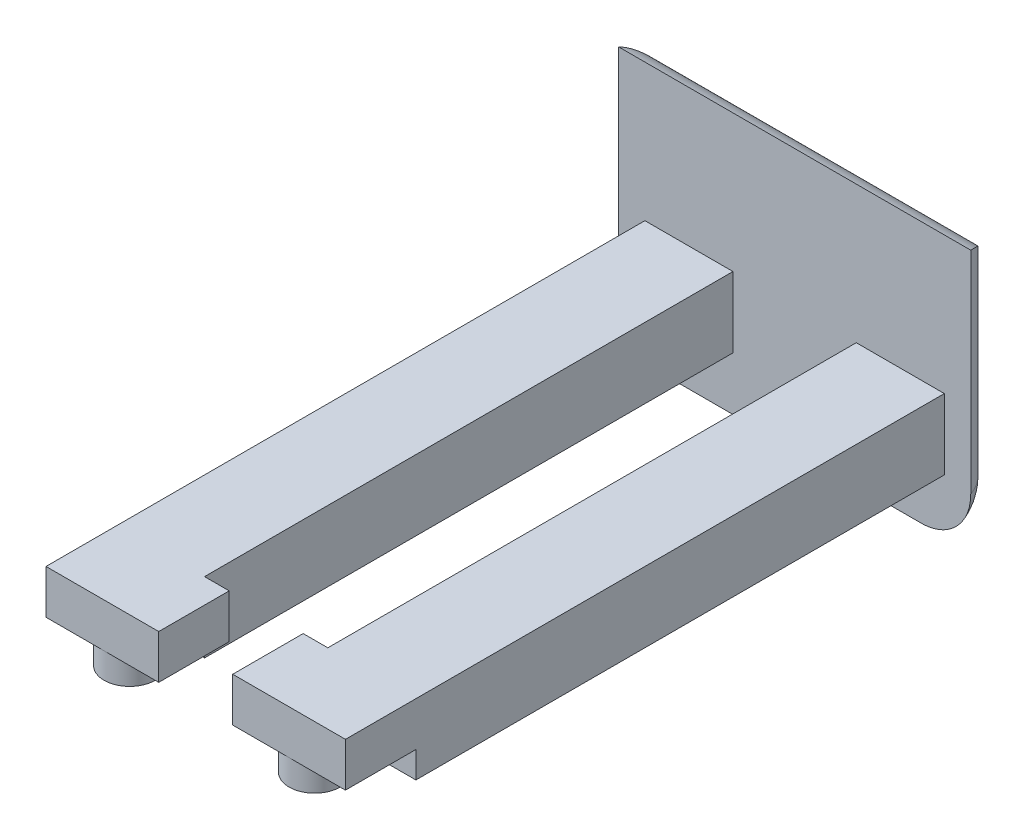
ISO-10303-21;
HEADER;
FILE_DESCRIPTION(('STEP AP214'),'2;1');
FILE_NAME('part.step','',(''),(''),'','','');
FILE_SCHEMA(('AUTOMOTIVE_DESIGN { 1 0 10303 214 1 1 1 1 }'));
ENDSEC;
DATA;
#1=APPLICATION_CONTEXT('core data for automotive mechanical design processes');
#2=APPLICATION_PROTOCOL_DEFINITION('international standard','automotive_design',2000,#1);
#3=PRODUCT_CONTEXT('',#1,'mechanical');
#4=PRODUCT('Part','Part','',(#3));
#5=PRODUCT_RELATED_PRODUCT_CATEGORY('part','',(#4));
#6=PRODUCT_DEFINITION_FORMATION('','',#4);
#7=PRODUCT_DEFINITION_CONTEXT('part definition',#1,'design');
#8=PRODUCT_DEFINITION('design','',#6,#7);
#9=PRODUCT_DEFINITION_SHAPE('','',#8);
#10=(LENGTH_UNIT() NAMED_UNIT(*) SI_UNIT(.MILLI.,.METRE.));
#11=(NAMED_UNIT(*) PLANE_ANGLE_UNIT() SI_UNIT($,.RADIAN.));
#12=(NAMED_UNIT(*) SI_UNIT($,.STERADIAN.) SOLID_ANGLE_UNIT());
#13=UNCERTAINTY_MEASURE_WITH_UNIT(LENGTH_MEASURE(1.E-05),#10,'distance_accuracy_value','');
#14=(GEOMETRIC_REPRESENTATION_CONTEXT(3) GLOBAL_UNCERTAINTY_ASSIGNED_CONTEXT((#13)) GLOBAL_UNIT_ASSIGNED_CONTEXT((#10,
#11,#12)) REPRESENTATION_CONTEXT('',''));
#15=CARTESIAN_POINT('',(0.,0.,0.));
#16=DIRECTION('',(0.,0.,1.));
#17=DIRECTION('',(1.,0.,0.));
#18=AXIS2_PLACEMENT_3D('',#15,#16,#17);
#19=CARTESIAN_POINT('',(-21.59,-0.762000000000002,81.28));
#20=DIRECTION('',(0.,-1.,0.));
#21=DIRECTION('',(0.,0.,-1.));
#22=AXIS2_PLACEMENT_3D('',#19,#20,#21);
#23=PLANE('',#22);
#24=DIRECTION('',(0.,0.,1.));
#25=VECTOR('',#24,1.);
#26=CARTESIAN_POINT('',(-5.33399999999999,-0.762000000000002,91.44));
#27=LINE('',#26,#25);
#28=CARTESIAN_POINT('',(-5.33399999999999,-0.762000000000002,81.28));
#29=VERTEX_POINT('',#28);
#30=CARTESIAN_POINT('',(-5.334,-0.762000000000002,91.44));
#31=VERTEX_POINT('',#30);
#32=EDGE_CURVE('E59',#29,#31,#27,.T.);
#33=ORIENTED_EDGE('',*,*,#32,.F.);
#34=DIRECTION('',(-1.,0.,0.));
#35=VECTOR('',#34,1.);
#36=CARTESIAN_POINT('',(-21.59,-0.762000000000002,81.28));
#37=LINE('',#36,#35);
#38=CARTESIAN_POINT('',(-8.89,-0.762000000000002,81.28));
#39=VERTEX_POINT('',#38);
#40=EDGE_CURVE('E245',#29,#39,#37,.T.);
#41=ORIENTED_EDGE('',*,*,#40,.T.);
#42=DIRECTION('',(0.,0.,1.));
#43=VECTOR('',#42,1.);
#44=CARTESIAN_POINT('',(-8.89,-0.762000000000003,-5.77088475655327));
#45=LINE('',#44,#43);
#46=CARTESIAN_POINT('',(-8.89,-0.762000000000003,5.08));
#47=VERTEX_POINT('',#46);
#48=EDGE_CURVE('E255',#47,#39,#45,.T.);
#49=ORIENTED_EDGE('',*,*,#48,.F.);
#50=DIRECTION('',(-1.,0.,0.));
#51=VECTOR('',#50,1.);
#52=CARTESIAN_POINT('',(-21.59,-0.762000000000002,5.08));
#53=LINE('',#52,#51);
#54=CARTESIAN_POINT('',(-21.59,-0.762000000000002,5.08));
#55=VERTEX_POINT('',#54);
#56=EDGE_CURVE('E290',#47,#55,#53,.T.);
#57=ORIENTED_EDGE('',*,*,#56,.T.);
#58=DIRECTION('',(0.,0.,-1.));
#59=VECTOR('',#58,1.);
#60=CARTESIAN_POINT('',(-21.59,-0.762000000000002,81.28));
#61=LINE('',#60,#59);
#62=CARTESIAN_POINT('',(-21.59,-0.762000000000002,91.44));
#63=VERTEX_POINT('',#62);
#64=EDGE_CURVE('E293',#63,#55,#61,.T.);
#65=ORIENTED_EDGE('',*,*,#64,.F.);
#66=DIRECTION('',(-1.,0.,0.));
#67=VECTOR('',#66,1.);
#68=CARTESIAN_POINT('',(-21.59,-0.762000000000002,91.44));
#69=LINE('',#68,#67);
#70=EDGE_CURVE('E199',#31,#63,#69,.T.);
#71=ORIENTED_EDGE('',*,*,#70,.F.);
#72=EDGE_LOOP('',(#33,#41,#49,#57,#65,#71));
#73=FACE_BOUND('',#72,.T.);
#74=ADVANCED_FACE('F42',(#73),#23,.F.);
#75=CARTESIAN_POINT('',(0.,-7.112,0.));
#76=DIRECTION('',(0.,-1.,0.));
#77=DIRECTION('',(0.,0.,-1.));
#78=AXIS2_PLACEMENT_3D('',#75,#76,#77);
#79=PLANE('',#78);
#80=CARTESIAN_POINT('',(-13.335,-7.112,87.63));
#81=DIRECTION('',(0.,-1.,0.));
#82=DIRECTION('',(0.,0.,-1.));
#83=AXIS2_PLACEMENT_3D('',#80,#81,#82);
#84=CIRCLE('',#83,3.683);
#85=CARTESIAN_POINT('',(-13.335,-7.112,83.947));
#86=VERTEX_POINT('',#85);
#87=EDGE_CURVE('E306',#86,#86,#84,.T.);
#88=ORIENTED_EDGE('',*,*,#87,.F.);
#89=EDGE_LOOP('',(#88));
#90=FACE_BOUND('',#89,.T.);
#91=DIRECTION('',(1.,0.,0.));
#92=VECTOR('',#91,1.);
#93=CARTESIAN_POINT('',(0.,-7.112,81.28));
#94=LINE('',#93,#92);
#95=CARTESIAN_POINT('',(-8.89,-7.112,81.28));
#96=VERTEX_POINT('',#95);
#97=CARTESIAN_POINT('',(-5.33399999999999,-7.112,81.28));
#98=VERTEX_POINT('',#97);
#99=EDGE_CURVE('E193',#96,#98,#94,.T.);
#100=ORIENTED_EDGE('',*,*,#99,.T.);
#101=DIRECTION('',(0.,0.,-1.));
#102=VECTOR('',#101,1.);
#103=CARTESIAN_POINT('',(-5.33399999999999,-7.112,91.44));
#104=LINE('',#103,#102);
#105=CARTESIAN_POINT('',(-5.33399999999999,-7.112,91.44));
#106=VERTEX_POINT('',#105);
#107=EDGE_CURVE('E180',#106,#98,#104,.T.);
#108=ORIENTED_EDGE('',*,*,#107,.F.);
#109=DIRECTION('',(1.,0.,0.));
#110=VECTOR('',#109,1.);
#111=CARTESIAN_POINT('',(-21.59,-7.112,91.44));
#112=LINE('',#111,#110);
#113=CARTESIAN_POINT('',(-21.59,-7.112,91.44));
#114=VERTEX_POINT('',#113);
#115=EDGE_CURVE('E190',#114,#106,#112,.T.);
#116=ORIENTED_EDGE('',*,*,#115,.F.);
#117=DIRECTION('',(0.,0.,-1.));
#118=VECTOR('',#117,1.);
#119=CARTESIAN_POINT('',(-21.59,-7.112,81.28));
#120=LINE('',#119,#118);
#121=CARTESIAN_POINT('',(-21.59,-7.112,81.28));
#122=VERTEX_POINT('',#121);
#123=EDGE_CURVE('E224',#114,#122,#120,.T.);
#124=ORIENTED_EDGE('',*,*,#123,.T.);
#125=DIRECTION('',(1.,0.,0.));
#126=VECTOR('',#125,1.);
#127=CARTESIAN_POINT('',(-5.07999999999999,-7.112,81.28));
#128=LINE('',#127,#126);
#129=EDGE_CURVE('E226',#122,#96,#128,.T.);
#130=ORIENTED_EDGE('',*,*,#129,.T.);
#131=EDGE_LOOP('',(#100,#108,#116,#124,#130));
#132=FACE_BOUND('',#131,.T.);
#133=ADVANCED_FACE('F189',(#90,#132),#79,.T.);
#134=CARTESIAN_POINT('',(0.,0.,81.28));
#135=DIRECTION('',(0.,0.,1.));
#136=DIRECTION('',(1.,0.,0.));
#137=AXIS2_PLACEMENT_3D('',#134,#135,#136);
#138=PLANE('',#137);
#139=DIRECTION('',(0.,1.,0.));
#140=VECTOR('',#139,1.);
#141=CARTESIAN_POINT('',(-5.33399999999999,-0.762000000000002,81.28));
#142=LINE('',#141,#140);
#143=EDGE_CURVE('E194',#98,#29,#142,.T.);
#144=ORIENTED_EDGE('',*,*,#143,.F.);
#145=ORIENTED_EDGE('',*,*,#99,.F.);
#146=DIRECTION('',(0.,-1.,0.));
#147=VECTOR('',#146,1.);
#148=CARTESIAN_POINT('',(-8.89,-0.762000000000003,81.28));
#149=LINE('',#148,#147);
#150=EDGE_CURVE('E252',#39,#96,#149,.T.);
#151=ORIENTED_EDGE('',*,*,#150,.F.);
#152=ORIENTED_EDGE('',*,*,#40,.F.);
#153=EDGE_LOOP('',(#144,#145,#151,#152));
#154=FACE_BOUND('',#153,.T.);
#155=ADVANCED_FACE('F378',(#154),#138,.F.);
#156=CARTESIAN_POINT('',(0.,0.,91.44));
#157=DIRECTION('',(0.,0.,1.));
#158=DIRECTION('',(1.,0.,0.));
#159=AXIS2_PLACEMENT_3D('',#156,#157,#158);
#160=PLANE('',#159);
#161=ORIENTED_EDGE('',*,*,#115,.T.);
#162=DIRECTION('',(0.,-1.,0.));
#163=VECTOR('',#162,1.);
#164=CARTESIAN_POINT('',(-5.33399999999999,-0.762000000000002,91.44));
#165=LINE('',#164,#163);
#166=EDGE_CURVE('E177',#31,#106,#165,.T.);
#167=ORIENTED_EDGE('',*,*,#166,.F.);
#168=ORIENTED_EDGE('',*,*,#70,.T.);
#169=DIRECTION('',(0.,-1.,0.));
#170=VECTOR('',#169,1.);
#171=CARTESIAN_POINT('',(-21.59,-0.762000000000002,91.44));
#172=LINE('',#171,#170);
#173=EDGE_CURVE('E198',#63,#114,#172,.T.);
#174=ORIENTED_EDGE('',*,*,#173,.T.);
#175=EDGE_LOOP('',(#161,#167,#168,#174));
#176=FACE_BOUND('',#175,.T.);
#177=ADVANCED_FACE('F196',(#176),#160,.T.);
#178=CARTESIAN_POINT('',(5.08,-0.762000000000002,81.28));
#179=DIRECTION('',(0.,-1.,0.));
#180=DIRECTION('',(0.,0.,-1.));
#181=AXIS2_PLACEMENT_3D('',#178,#179,#180);
#182=PLANE('',#181);
#183=DIRECTION('',(0.,0.,-1.));
#184=VECTOR('',#183,1.);
#185=CARTESIAN_POINT('',(5.33399999999999,-0.762000000000004,81.28));
#186=LINE('',#185,#184);
#187=CARTESIAN_POINT('',(5.33399999999999,-0.762000000000004,91.44));
#188=VERTEX_POINT('',#187);
#189=CARTESIAN_POINT('',(5.33399999999999,-0.762000000000004,81.28));
#190=VERTEX_POINT('',#189);
#191=EDGE_CURVE('E210',#188,#190,#186,.T.);
#192=ORIENTED_EDGE('',*,*,#191,.F.);
#193=DIRECTION('',(-1.,0.,0.));
#194=VECTOR('',#193,1.);
#195=CARTESIAN_POINT('',(5.07999999999999,-0.762000000000004,91.44));
#196=LINE('',#195,#194);
#197=CARTESIAN_POINT('',(21.59,-0.762000000000004,91.44));
#198=VERTEX_POINT('',#197);
#199=EDGE_CURVE('E203',#198,#188,#196,.T.);
#200=ORIENTED_EDGE('',*,*,#199,.F.);
#201=DIRECTION('',(0.,0.,-1.));
#202=VECTOR('',#201,1.);
#203=CARTESIAN_POINT('',(21.59,-0.762000000000002,81.28));
#204=LINE('',#203,#202);
#205=CARTESIAN_POINT('',(21.59,-0.762000000000002,5.08));
#206=VERTEX_POINT('',#205);
#207=EDGE_CURVE('E280',#198,#206,#204,.T.);
#208=ORIENTED_EDGE('',*,*,#207,.T.);
#209=DIRECTION('',(-1.,0.,0.));
#210=VECTOR('',#209,1.);
#211=CARTESIAN_POINT('',(5.08,-0.762000000000002,5.08));
#212=LINE('',#211,#210);
#213=CARTESIAN_POINT('',(8.89,-0.762000000000002,5.08));
#214=VERTEX_POINT('',#213);
#215=EDGE_CURVE('E277',#206,#214,#212,.T.);
#216=ORIENTED_EDGE('',*,*,#215,.T.);
#217=DIRECTION('',(0.,0.,1.));
#218=VECTOR('',#217,1.);
#219=CARTESIAN_POINT('',(8.89,-0.762000000000002,-5.77088475655327));
#220=LINE('',#219,#218);
#221=CARTESIAN_POINT('',(8.89,-0.762000000000002,81.28));
#222=VERTEX_POINT('',#221);
#223=EDGE_CURVE('E263',#214,#222,#220,.T.);
#224=ORIENTED_EDGE('',*,*,#223,.T.);
#225=DIRECTION('',(-1.,0.,0.));
#226=VECTOR('',#225,1.);
#227=CARTESIAN_POINT('',(21.59,-0.762000000000002,81.28));
#228=LINE('',#227,#226);
#229=EDGE_CURVE('E233',#222,#190,#228,.T.);
#230=ORIENTED_EDGE('',*,*,#229,.T.);
#231=EDGE_LOOP('',(#192,#200,#208,#216,#224,#230));
#232=FACE_BOUND('',#231,.T.);
#233=ADVANCED_FACE('F438',(#232),#182,.F.);
#234=CARTESIAN_POINT('',(0.,-7.112,0.));
#235=DIRECTION('',(0.,1.,0.));
#236=DIRECTION('',(0.,0.,1.));
#237=AXIS2_PLACEMENT_3D('',#234,#235,#236);
#238=PLANE('',#237);
#239=CARTESIAN_POINT('',(13.335,-7.112,87.63));
#240=DIRECTION('',(0.,-1.,0.));
#241=DIRECTION('',(0.,0.,-1.));
#242=AXIS2_PLACEMENT_3D('',#239,#240,#241);
#243=CIRCLE('',#242,3.683);
#244=CARTESIAN_POINT('',(13.335,-7.112,83.947));
#245=VERTEX_POINT('',#244);
#246=EDGE_CURVE('E214',#245,#245,#243,.T.);
#247=ORIENTED_EDGE('',*,*,#246,.F.);
#248=EDGE_LOOP('',(#247));
#249=FACE_BOUND('',#248,.T.);
#250=DIRECTION('',(0.,0.,1.));
#251=VECTOR('',#250,1.);
#252=CARTESIAN_POINT('',(5.33399999999999,-7.112,81.28));
#253=LINE('',#252,#251);
#254=CARTESIAN_POINT('',(5.33399999999999,-7.112,81.28));
#255=VERTEX_POINT('',#254);
#256=CARTESIAN_POINT('',(5.33399999999999,-7.112,91.44));
#257=VERTEX_POINT('',#256);
#258=EDGE_CURVE('E67',#255,#257,#253,.T.);
#259=ORIENTED_EDGE('',*,*,#258,.F.);
#260=DIRECTION('',(1.,0.,0.));
#261=VECTOR('',#260,1.);
#262=CARTESIAN_POINT('',(5.07999999999999,-7.112,81.28));
#263=LINE('',#262,#261);
#264=CARTESIAN_POINT('',(8.89,-7.112,81.28));
#265=VERTEX_POINT('',#264);
#266=EDGE_CURVE('E234',#255,#265,#263,.T.);
#267=ORIENTED_EDGE('',*,*,#266,.T.);
#268=CARTESIAN_POINT('',(21.59,-7.112,81.28));
#269=VERTEX_POINT('',#268);
#270=EDGE_CURVE('E237',#265,#269,#263,.T.);
#271=ORIENTED_EDGE('',*,*,#270,.T.);
#272=DIRECTION('',(0.,0.,1.));
#273=VECTOR('',#272,1.);
#274=CARTESIAN_POINT('',(21.59,-7.112,81.28));
#275=LINE('',#274,#273);
#276=CARTESIAN_POINT('',(21.59,-7.112,91.44));
#277=VERTEX_POINT('',#276);
#278=EDGE_CURVE('E236',#269,#277,#275,.T.);
#279=ORIENTED_EDGE('',*,*,#278,.T.);
#280=DIRECTION('',(1.,0.,0.));
#281=VECTOR('',#280,1.);
#282=CARTESIAN_POINT('',(5.07999999999999,-7.112,91.44));
#283=LINE('',#282,#281);
#284=EDGE_CURVE('E207',#257,#277,#283,.T.);
#285=ORIENTED_EDGE('',*,*,#284,.F.);
#286=EDGE_LOOP('',(#259,#267,#271,#279,#285));
#287=FACE_BOUND('',#286,.T.);
#288=ADVANCED_FACE('F442',(#249,#287),#238,.F.);
#289=CARTESIAN_POINT('',(0.,0.,81.28));
#290=DIRECTION('',(0.,0.,-1.));
#291=DIRECTION('',(-1.,0.,0.));
#292=AXIS2_PLACEMENT_3D('',#289,#290,#291);
#293=PLANE('',#292);
#294=ORIENTED_EDGE('',*,*,#266,.F.);
#295=DIRECTION('',(0.,-1.,0.));
#296=VECTOR('',#295,1.);
#297=CARTESIAN_POINT('',(5.33399999999999,-0.762000000000004,81.28));
#298=LINE('',#297,#296);
#299=EDGE_CURVE('E545',#190,#255,#298,.T.);
#300=ORIENTED_EDGE('',*,*,#299,.F.);
#301=ORIENTED_EDGE('',*,*,#229,.F.);
#302=DIRECTION('',(0.,1.,0.));
#303=VECTOR('',#302,1.);
#304=CARTESIAN_POINT('',(8.89,-0.762000000000002,81.28));
#305=LINE('',#304,#303);
#306=EDGE_CURVE('E247',#265,#222,#305,.T.);
#307=ORIENTED_EDGE('',*,*,#306,.F.);
#308=EDGE_LOOP('',(#294,#300,#301,#307));
#309=FACE_BOUND('',#308,.T.);
#310=ADVANCED_FACE('F451',(#309),#293,.T.);
#311=CARTESIAN_POINT('',(0.,0.,91.44));
#312=DIRECTION('',(0.,0.,1.));
#313=DIRECTION('',(1.,0.,0.));
#314=AXIS2_PLACEMENT_3D('',#311,#312,#313);
#315=PLANE('',#314);
#316=ORIENTED_EDGE('',*,*,#199,.T.);
#317=DIRECTION('',(0.,1.,0.));
#318=VECTOR('',#317,1.);
#319=CARTESIAN_POINT('',(5.33399999999999,-0.762000000000004,91.44));
#320=LINE('',#319,#318);
#321=EDGE_CURVE('E548',#257,#188,#320,.T.);
#322=ORIENTED_EDGE('',*,*,#321,.F.);
#323=ORIENTED_EDGE('',*,*,#284,.T.);
#324=DIRECTION('',(0.,1.,0.));
#325=VECTOR('',#324,1.);
#326=CARTESIAN_POINT('',(21.59,-0.762000000000004,91.44));
#327=LINE('',#326,#325);
#328=EDGE_CURVE('E209',#277,#198,#327,.T.);
#329=ORIENTED_EDGE('',*,*,#328,.T.);
#330=EDGE_LOOP('',(#316,#322,#323,#329));
#331=FACE_BOUND('',#330,.T.);
#332=ADVANCED_FACE('F394',(#331),#315,.T.);
#333=CARTESIAN_POINT('',(-21.59,-0.762000000000002,81.28));
#334=DIRECTION('',(1.,0.,0.));
#335=DIRECTION('',(0.,0.,-1.));
#336=AXIS2_PLACEMENT_3D('',#333,#334,#335);
#337=PLANE('',#336);
#338=ORIENTED_EDGE('',*,*,#173,.F.);
#339=ORIENTED_EDGE('',*,*,#64,.T.);
#340=DIRECTION('',(0.,-1.,0.));
#341=VECTOR('',#340,1.);
#342=CARTESIAN_POINT('',(-21.59,-0.762000000000002,5.08));
#343=LINE('',#342,#341);
#344=CARTESIAN_POINT('',(-21.59,-10.922,5.08));
#345=VERTEX_POINT('',#344);
#346=EDGE_CURVE('E284',#55,#345,#343,.T.);
#347=ORIENTED_EDGE('',*,*,#346,.T.);
#348=DIRECTION('',(0.,0.,-1.));
#349=VECTOR('',#348,1.);
#350=CARTESIAN_POINT('',(-21.59,-10.922,81.28));
#351=LINE('',#350,#349);
#352=CARTESIAN_POINT('',(-21.59,-10.922,81.28));
#353=VERTEX_POINT('',#352);
#354=EDGE_CURVE('E295',#353,#345,#351,.T.);
#355=ORIENTED_EDGE('',*,*,#354,.F.);
#356=DIRECTION('',(0.,-1.,0.));
#357=VECTOR('',#356,1.);
#358=CARTESIAN_POINT('',(-21.59,-7.112,81.28));
#359=LINE('',#358,#357);
#360=EDGE_CURVE('E229',#122,#353,#359,.T.);
#361=ORIENTED_EDGE('',*,*,#360,.F.);
#362=ORIENTED_EDGE('',*,*,#123,.F.);
#363=EDGE_LOOP('',(#338,#339,#347,#355,#361,#362));
#364=FACE_BOUND('',#363,.T.);
#365=ADVANCED_FACE('F390',(#364),#337,.F.);
#366=CARTESIAN_POINT('',(21.59,-0.762000000000002,81.28));
#367=DIRECTION('',(-1.,0.,0.));
#368=DIRECTION('',(0.,0.,1.));
#369=AXIS2_PLACEMENT_3D('',#366,#367,#368);
#370=PLANE('',#369);
#371=ORIENTED_EDGE('',*,*,#328,.F.);
#372=ORIENTED_EDGE('',*,*,#278,.F.);
#373=DIRECTION('',(0.,-1.,0.));
#374=VECTOR('',#373,1.);
#375=CARTESIAN_POINT('',(21.59,-7.112,81.28));
#376=LINE('',#375,#374);
#377=CARTESIAN_POINT('',(21.59,-10.922,81.28));
#378=VERTEX_POINT('',#377);
#379=EDGE_CURVE('E231',#269,#378,#376,.T.);
#380=ORIENTED_EDGE('',*,*,#379,.T.);
#381=DIRECTION('',(0.,0.,-1.));
#382=VECTOR('',#381,1.);
#383=CARTESIAN_POINT('',(21.59,-10.922,81.28));
#384=LINE('',#383,#382);
#385=CARTESIAN_POINT('',(21.59,-10.922,5.08));
#386=VERTEX_POINT('',#385);
#387=EDGE_CURVE('E282',#378,#386,#384,.T.);
#388=ORIENTED_EDGE('',*,*,#387,.T.);
#389=DIRECTION('',(0.,1.,0.));
#390=VECTOR('',#389,1.);
#391=CARTESIAN_POINT('',(21.59,-0.762000000000002,5.08));
#392=LINE('',#391,#390);
#393=EDGE_CURVE('E274',#386,#206,#392,.T.);
#394=ORIENTED_EDGE('',*,*,#393,.T.);
#395=ORIENTED_EDGE('',*,*,#207,.F.);
#396=EDGE_LOOP('',(#371,#372,#380,#388,#394,#395));
#397=FACE_BOUND('',#396,.T.);
#398=ADVANCED_FACE('F393',(#397),#370,.F.);
#399=CARTESIAN_POINT('',(0.,0.,5.08));
#400=DIRECTION('',(0.,0.,1.));
#401=DIRECTION('',(1.,0.,0.));
#402=AXIS2_PLACEMENT_3D('',#399,#400,#401);
#403=PLANE('',#402);
#404=DIRECTION('',(0.,-1.,0.));
#405=VECTOR('',#404,1.);
#406=CARTESIAN_POINT('',(-25.4,-19.05,5.08));
#407=LINE('',#406,#405);
#408=CARTESIAN_POINT('',(-25.4,19.05,5.08));
#409=VERTEX_POINT('',#408);
#410=CARTESIAN_POINT('',(-25.4,-11.43,5.08));
#411=VERTEX_POINT('',#410);
#412=EDGE_CURVE('E297',#409,#411,#407,.T.);
#413=ORIENTED_EDGE('',*,*,#412,.T.);
#414=CARTESIAN_POINT('',(-18.2157951031447,-11.43,5.08));
#415=DIRECTION('',(0.,0.,1.));
#416=DIRECTION('',(1.,0.,0.));
#417=AXIS2_PLACEMENT_3D('',#414,#415,#416);
#418=CIRCLE('',#417,7.18420489685532);
#419=CARTESIAN_POINT('',(-18.2157951031447,-18.6142048968553,5.08));
#420=VERTEX_POINT('',#419);
#421=EDGE_CURVE('E328',#411,#420,#418,.T.);
#422=ORIENTED_EDGE('',*,*,#421,.T.);
#423=DIRECTION('',(1.,0.,0.));
#424=VECTOR('',#423,1.);
#425=CARTESIAN_POINT('',(0.,-18.6142048968553,5.08));
#426=LINE('',#425,#424);
#427=CARTESIAN_POINT('',(18.2157951031447,-18.6142048968553,5.08));
#428=VERTEX_POINT('',#427);
#429=EDGE_CURVE('E324',#420,#428,#426,.T.);
#430=ORIENTED_EDGE('',*,*,#429,.T.);
#431=CARTESIAN_POINT('',(18.2157951031447,-11.43,5.08));
#432=DIRECTION('',(0.,0.,1.));
#433=DIRECTION('',(1.,0.,0.));
#434=AXIS2_PLACEMENT_3D('',#431,#432,#433);
#435=CIRCLE('',#434,7.18420489685532);
#436=CARTESIAN_POINT('',(25.4,-11.43,5.08));
#437=VERTEX_POINT('',#436);
#438=EDGE_CURVE('E326',#428,#437,#435,.T.);
#439=ORIENTED_EDGE('',*,*,#438,.T.);
#440=DIRECTION('',(0.,1.,0.));
#441=VECTOR('',#440,1.);
#442=CARTESIAN_POINT('',(25.4,-19.05,5.08));
#443=LINE('',#442,#441);
#444=CARTESIAN_POINT('',(25.4,19.05,5.08));
#445=VERTEX_POINT('',#444);
#446=EDGE_CURVE('E300',#437,#445,#443,.T.);
#447=ORIENTED_EDGE('',*,*,#446,.T.);
#448=DIRECTION('',(-1.,0.,0.));
#449=VECTOR('',#448,1.);
#450=CARTESIAN_POINT('',(25.4,19.05,5.08));
#451=LINE('',#450,#449);
#452=EDGE_CURVE('E302',#445,#409,#451,.T.);
#453=ORIENTED_EDGE('',*,*,#452,.T.);
#454=EDGE_LOOP('',(#413,#422,#430,#439,#447,#453));
#455=FACE_BOUND('',#454,.T.);
#456=DIRECTION('',(0.,1.,0.));
#457=VECTOR('',#456,1.);
#458=CARTESIAN_POINT('',(-8.89,-0.762000000000003,5.08));
#459=LINE('',#458,#457);
#460=CARTESIAN_POINT('',(-8.89,-10.922,5.08));
#461=VERTEX_POINT('',#460);
#462=EDGE_CURVE('E248',#461,#47,#459,.T.);
#463=ORIENTED_EDGE('',*,*,#462,.F.);
#464=DIRECTION('',(1.,0.,0.));
#465=VECTOR('',#464,1.);
#466=CARTESIAN_POINT('',(-21.59,-10.922,5.08));
#467=LINE('',#466,#465);
#468=EDGE_CURVE('E287',#345,#461,#467,.T.);
#469=ORIENTED_EDGE('',*,*,#468,.F.);
#470=ORIENTED_EDGE('',*,*,#346,.F.);
#471=ORIENTED_EDGE('',*,*,#56,.F.);
#472=EDGE_LOOP('',(#463,#469,#470,#471));
#473=FACE_BOUND('',#472,.T.);
#474=DIRECTION('',(1.,0.,0.));
#475=VECTOR('',#474,1.);
#476=CARTESIAN_POINT('',(5.08,-10.922,5.08));
#477=LINE('',#476,#475);
#478=CARTESIAN_POINT('',(8.89,-10.922,5.08));
#479=VERTEX_POINT('',#478);
#480=EDGE_CURVE('E250',#479,#386,#477,.T.);
#481=ORIENTED_EDGE('',*,*,#480,.F.);
#482=DIRECTION('',(0.,-1.,0.));
#483=VECTOR('',#482,1.);
#484=CARTESIAN_POINT('',(8.89,-0.762000000000002,5.08));
#485=LINE('',#484,#483);
#486=EDGE_CURVE('E261',#214,#479,#485,.T.);
#487=ORIENTED_EDGE('',*,*,#486,.F.);
#488=ORIENTED_EDGE('',*,*,#215,.F.);
#489=ORIENTED_EDGE('',*,*,#393,.F.);
#490=EDGE_LOOP('',(#481,#487,#488,#489));
#491=FACE_BOUND('',#490,.T.);
#492=ADVANCED_FACE('F345',(#455,#473,#491),#403,.T.);
#493=CARTESIAN_POINT('',(0.,0.,0.));
#494=DIRECTION('',(0.,0.,1.));
#495=DIRECTION('',(1.,0.,0.));
#496=AXIS2_PLACEMENT_3D('',#493,#494,#495);
#497=PLANE('',#496);
#498=DIRECTION('',(0.,1.,0.));
#499=VECTOR('',#498,1.);
#500=CARTESIAN_POINT('',(18.2157951031447,0.,0.));
#501=LINE('',#500,#499);
#502=CARTESIAN_POINT('',(18.2157951031447,11.8657951031447,0.));
#503=VERTEX_POINT('',#502);
#504=CARTESIAN_POINT('',(18.2157951031447,-11.43,0.));
#505=VERTEX_POINT('',#504);
#506=EDGE_CURVE('E312',#503,#505,#501,.F.);
#507=ORIENTED_EDGE('',*,*,#506,.T.);
#508=DIRECTION('',(1.,0.,0.));
#509=VECTOR('',#508,1.);
#510=CARTESIAN_POINT('',(0.,-11.43,0.));
#511=LINE('',#510,#509);
#512=CARTESIAN_POINT('',(-18.2157951031447,-11.43,0.));
#513=VERTEX_POINT('',#512);
#514=EDGE_CURVE('E11',#505,#513,#511,.F.);
#515=ORIENTED_EDGE('',*,*,#514,.T.);
#516=DIRECTION('',(0.,-1.,0.));
#517=VECTOR('',#516,1.);
#518=CARTESIAN_POINT('',(-18.2157951031447,0.,0.));
#519=LINE('',#518,#517);
#520=CARTESIAN_POINT('',(-18.2157951031447,11.8657951031447,0.));
#521=VERTEX_POINT('',#520);
#522=EDGE_CURVE('E315',#513,#521,#519,.F.);
#523=ORIENTED_EDGE('',*,*,#522,.T.);
#524=DIRECTION('',(-1.,0.,0.));
#525=VECTOR('',#524,1.);
#526=CARTESIAN_POINT('',(0.,11.8657951031447,0.));
#527=LINE('',#526,#525);
#528=EDGE_CURVE('E309',#521,#503,#527,.F.);
#529=ORIENTED_EDGE('',*,*,#528,.T.);
#530=EDGE_LOOP('',(#507,#515,#523,#529));
#531=FACE_BOUND('',#530,.T.);
#532=ADVANCED_FACE('F388',(#531),#497,.F.);
#533=CARTESIAN_POINT('',(-21.59,-10.922,81.28));
#534=DIRECTION('',(0.,1.,0.));
#535=DIRECTION('',(0.,0.,1.));
#536=AXIS2_PLACEMENT_3D('',#533,#534,#535);
#537=PLANE('',#536);
#538=DIRECTION('',(0.,0.,1.));
#539=VECTOR('',#538,1.);
#540=CARTESIAN_POINT('',(-8.89,-10.922,-5.77088475655327));
#541=LINE('',#540,#539);
#542=CARTESIAN_POINT('',(-8.89,-10.922,81.28));
#543=VERTEX_POINT('',#542);
#544=EDGE_CURVE('E251',#461,#543,#541,.T.);
#545=ORIENTED_EDGE('',*,*,#544,.T.);
#546=DIRECTION('',(1.,0.,0.));
#547=VECTOR('',#546,1.);
#548=CARTESIAN_POINT('',(-5.07999999999999,-10.922,81.28));
#549=LINE('',#548,#547);
#550=EDGE_CURVE('E227',#353,#543,#549,.T.);
#551=ORIENTED_EDGE('',*,*,#550,.F.);
#552=ORIENTED_EDGE('',*,*,#354,.T.);
#553=ORIENTED_EDGE('',*,*,#468,.T.);
#554=EDGE_LOOP('',(#545,#551,#552,#553));
#555=FACE_BOUND('',#554,.T.);
#556=ADVANCED_FACE('F385',(#555),#537,.F.);
#557=CARTESIAN_POINT('',(5.08,-10.922,81.28));
#558=DIRECTION('',(0.,1.,0.));
#559=DIRECTION('',(0.,0.,1.));
#560=AXIS2_PLACEMENT_3D('',#557,#558,#559);
#561=PLANE('',#560);
#562=ORIENTED_EDGE('',*,*,#387,.F.);
#563=DIRECTION('',(1.,0.,0.));
#564=VECTOR('',#563,1.);
#565=CARTESIAN_POINT('',(5.07999999999999,-10.922,81.28));
#566=LINE('',#565,#564);
#567=CARTESIAN_POINT('',(8.89,-10.922,81.28));
#568=VERTEX_POINT('',#567);
#569=EDGE_CURVE('E223',#568,#378,#566,.T.);
#570=ORIENTED_EDGE('',*,*,#569,.F.);
#571=DIRECTION('',(0.,0.,1.));
#572=VECTOR('',#571,1.);
#573=CARTESIAN_POINT('',(8.89,-10.922,-5.77088475655327));
#574=LINE('',#573,#572);
#575=EDGE_CURVE('E267',#479,#568,#574,.T.);
#576=ORIENTED_EDGE('',*,*,#575,.F.);
#577=ORIENTED_EDGE('',*,*,#480,.T.);
#578=EDGE_LOOP('',(#562,#570,#576,#577));
#579=FACE_BOUND('',#578,.T.);
#580=ADVANCED_FACE('F383',(#579),#561,.F.);
#581=CARTESIAN_POINT('',(8.89,-0.762000000000002,-5.77088475655327));
#582=DIRECTION('',(1.,0.,0.));
#583=DIRECTION('',(0.,1.,0.));
#584=AXIS2_PLACEMENT_3D('',#581,#582,#583);
#585=PLANE('',#584);
#586=ORIENTED_EDGE('',*,*,#486,.T.);
#587=ORIENTED_EDGE('',*,*,#575,.T.);
#588=EDGE_CURVE('E264',#568,#265,#305,.T.);
#589=ORIENTED_EDGE('',*,*,#588,.T.);
#590=ORIENTED_EDGE('',*,*,#306,.T.);
#591=ORIENTED_EDGE('',*,*,#223,.F.);
#592=EDGE_LOOP('',(#586,#587,#589,#590,#591));
#593=FACE_BOUND('',#592,.T.);
#594=ADVANCED_FACE('F519',(#593),#585,.F.);
#595=CARTESIAN_POINT('',(-8.89,-0.762000000000003,-5.77088475655327));
#596=DIRECTION('',(-1.,0.,0.));
#597=DIRECTION('',(0.,-1.,0.));
#598=AXIS2_PLACEMENT_3D('',#595,#596,#597);
#599=PLANE('',#598);
#600=ORIENTED_EDGE('',*,*,#462,.T.);
#601=ORIENTED_EDGE('',*,*,#48,.T.);
#602=ORIENTED_EDGE('',*,*,#150,.T.);
#603=EDGE_CURVE('E256',#96,#543,#149,.T.);
#604=ORIENTED_EDGE('',*,*,#603,.T.);
#605=ORIENTED_EDGE('',*,*,#544,.F.);
#606=EDGE_LOOP('',(#600,#601,#602,#604,#605));
#607=FACE_BOUND('',#606,.T.);
#608=ADVANCED_FACE('F515',(#607),#599,.F.);
#609=CARTESIAN_POINT('',(5.07999999999999,-7.112,81.28));
#610=DIRECTION('',(0.,0.,-1.));
#611=DIRECTION('',(-1.,0.,0.));
#612=AXIS2_PLACEMENT_3D('',#609,#610,#611);
#613=PLANE('',#612);
#614=ORIENTED_EDGE('',*,*,#569,.T.);
#615=ORIENTED_EDGE('',*,*,#379,.F.);
#616=ORIENTED_EDGE('',*,*,#270,.F.);
#617=ORIENTED_EDGE('',*,*,#588,.F.);
#618=EDGE_LOOP('',(#614,#615,#616,#617));
#619=FACE_BOUND('',#618,.T.);
#620=ADVANCED_FACE('F518',(#619),#613,.F.);
#621=CARTESIAN_POINT('',(-5.07999999999999,-7.112,81.28));
#622=DIRECTION('',(0.,0.,-1.));
#623=DIRECTION('',(-1.,0.,0.));
#624=AXIS2_PLACEMENT_3D('',#621,#622,#623);
#625=PLANE('',#624);
#626=ORIENTED_EDGE('',*,*,#129,.F.);
#627=ORIENTED_EDGE('',*,*,#360,.T.);
#628=ORIENTED_EDGE('',*,*,#550,.T.);
#629=ORIENTED_EDGE('',*,*,#603,.F.);
#630=EDGE_LOOP('',(#626,#627,#628,#629));
#631=FACE_BOUND('',#630,.T.);
#632=ADVANCED_FACE('F570',(#631),#625,.F.);
#633=CARTESIAN_POINT('',(-13.335,-7.112,87.63));
#634=DIRECTION('',(0.,-1.,0.));
#635=DIRECTION('',(0.,0.,-1.));
#636=AXIS2_PLACEMENT_3D('',#633,#634,#635);
#637=CYLINDRICAL_SURFACE('',#636,3.683);
#638=CARTESIAN_POINT('',(-13.335,-10.922,87.63));
#639=DIRECTION('',(0.,-1.,0.));
#640=DIRECTION('',(0.,0.,-1.));
#641=AXIS2_PLACEMENT_3D('',#638,#639,#640);
#642=CIRCLE('',#641,3.683);
#643=CARTESIAN_POINT('',(-13.335,-10.922,83.947));
#644=VERTEX_POINT('',#643);
#645=EDGE_CURVE('E217',#644,#644,#642,.T.);
#646=CARTESIAN_POINT('',(-13.335,-7.112,83.947));
#647=CARTESIAN_POINT('',(-13.335,-7.1516875,83.947));
#648=CARTESIAN_POINT('',(-13.335,-7.191375,83.947));
#649=CARTESIAN_POINT('',(-13.335,-7.27075,83.947));
#650=CARTESIAN_POINT('',(-13.335,-7.3104375,83.947));
#651=CARTESIAN_POINT('',(-13.335,-7.3898125,83.947));
#652=CARTESIAN_POINT('',(-13.335,-7.4295,83.947));
#653=CARTESIAN_POINT('',(-13.335,-7.508875,83.947));
#654=CARTESIAN_POINT('',(-13.335,-7.5485625,83.947));
#655=CARTESIAN_POINT('',(-13.335,-7.6279375,83.947));
#656=CARTESIAN_POINT('',(-13.335,-7.667625,83.947));
#657=CARTESIAN_POINT('',(-13.335,-7.747,83.947));
#658=CARTESIAN_POINT('',(-13.335,-7.7866875,83.947));
#659=CARTESIAN_POINT('',(-13.335,-7.8660625,83.947));
#660=CARTESIAN_POINT('',(-13.335,-7.90575,83.947));
#661=CARTESIAN_POINT('',(-13.335,-7.985125,83.947));
#662=CARTESIAN_POINT('',(-13.335,-8.0248125,83.947));
#663=CARTESIAN_POINT('',(-13.335,-8.1041875,83.947));
#664=CARTESIAN_POINT('',(-13.335,-8.143875,83.947));
#665=CARTESIAN_POINT('',(-13.335,-8.22325,83.947));
#666=CARTESIAN_POINT('',(-13.335,-8.2629375,83.947));
#667=CARTESIAN_POINT('',(-13.335,-8.3423125,83.947));
#668=CARTESIAN_POINT('',(-13.335,-8.382,83.947));
#669=CARTESIAN_POINT('',(-13.335,-8.461375,83.947));
#670=CARTESIAN_POINT('',(-13.335,-8.5010625,83.947));
#671=CARTESIAN_POINT('',(-13.335,-8.5804375,83.947));
#672=CARTESIAN_POINT('',(-13.335,-8.620125,83.947));
#673=CARTESIAN_POINT('',(-13.335,-8.6995,83.947));
#674=CARTESIAN_POINT('',(-13.335,-8.7391875,83.947));
#675=CARTESIAN_POINT('',(-13.335,-8.8185625,83.947));
#676=CARTESIAN_POINT('',(-13.335,-8.85825,83.947));
#677=CARTESIAN_POINT('',(-13.335,-8.937625,83.947));
#678=CARTESIAN_POINT('',(-13.335,-8.9773125,83.947));
#679=CARTESIAN_POINT('',(-13.335,-9.0566875,83.947));
#680=CARTESIAN_POINT('',(-13.335,-9.096375,83.947));
#681=CARTESIAN_POINT('',(-13.335,-9.17575,83.947));
#682=CARTESIAN_POINT('',(-13.335,-9.2154375,83.947));
#683=CARTESIAN_POINT('',(-13.335,-9.2948125,83.947));
#684=CARTESIAN_POINT('',(-13.335,-9.3345,83.947));
#685=CARTESIAN_POINT('',(-13.335,-9.413875,83.947));
#686=CARTESIAN_POINT('',(-13.335,-9.4535625,83.947));
#687=CARTESIAN_POINT('',(-13.335,-9.5329375,83.947));
#688=CARTESIAN_POINT('',(-13.335,-9.572625,83.947));
#689=CARTESIAN_POINT('',(-13.335,-9.652,83.947));
#690=CARTESIAN_POINT('',(-13.335,-9.6916875,83.947));
#691=CARTESIAN_POINT('',(-13.335,-9.7710625,83.947));
#692=CARTESIAN_POINT('',(-13.335,-9.81075,83.947));
#693=CARTESIAN_POINT('',(-13.335,-9.890125,83.947));
#694=CARTESIAN_POINT('',(-13.335,-9.9298125,83.947));
#695=CARTESIAN_POINT('',(-13.335,-10.0091875,83.947));
#696=CARTESIAN_POINT('',(-13.335,-10.048875,83.947));
#697=CARTESIAN_POINT('',(-13.335,-10.12825,83.947));
#698=CARTESIAN_POINT('',(-13.335,-10.1679375,83.947));
#699=CARTESIAN_POINT('',(-13.335,-10.2473125,83.947));
#700=CARTESIAN_POINT('',(-13.335,-10.287,83.947));
#701=CARTESIAN_POINT('',(-13.335,-10.366375,83.947));
#702=CARTESIAN_POINT('',(-13.335,-10.4060625,83.947));
#703=CARTESIAN_POINT('',(-13.335,-10.4854375,83.947));
#704=CARTESIAN_POINT('',(-13.335,-10.525125,83.947));
#705=CARTESIAN_POINT('',(-13.335,-10.6045,83.947));
#706=CARTESIAN_POINT('',(-13.335,-10.6441875,83.947));
#707=CARTESIAN_POINT('',(-13.335,-10.7235625,83.947));
#708=CARTESIAN_POINT('',(-13.335,-10.76325,83.947));
#709=CARTESIAN_POINT('',(-13.335,-10.842625,83.947));
#710=CARTESIAN_POINT('',(-13.335,-10.8823125,83.947));
#711=CARTESIAN_POINT('',(-13.335,-10.922,83.947));
#712=B_SPLINE_CURVE_WITH_KNOTS('',3,(#646,#647,#648,#649,#650,#651,#652,#653,#654,#655,#656,
#657,#658,#659,#660,#661,#662,#663,#664,#665,#666,#667,#668,#669,#670,#671,#672,#673,#674,#675,
#676,#677,#678,#679,#680,#681,#682,#683,#684,#685,#686,#687,#688,#689,#690,#691,#692,#693,#694,
#695,#696,#697,#698,#699,#700,#701,#702,#703,#704,#705,#706,#707,#708,#709,#710,#711),
.UNSPECIFIED.,.F.,.F.,(4,2,2,2,2,2,2,2,2,2,2,2,2,2,2,2,2,2,2,2,2,2,2,2,2,2,2,2,2,2,2,2,4),(0.,
0.119062499999999,0.238125,0.3571875,0.476249999999999,0.595312499999999,0.714375,
0.833437499999999,0.952499999999998,1.0715625,1.190625,1.3096875,1.42875,1.5478125,1.666875,
1.7859375,1.905,2.0240625,2.143125,2.2621875,2.38125,2.5003125,2.619375,2.7384375,2.8575,
2.9765625,3.095625,3.2146875,3.33375,3.4528125,3.571875,3.6909375,3.81),.UNSPECIFIED.);
#713=EDGE_CURVE('BSEAM573',#86,#644,#712,.T.);
#714=ORIENTED_EDGE('',*,*,#87,.T.);
#715=ORIENTED_EDGE('',*,*,#645,.F.);
#716=ORIENTED_EDGE('',*,*,#713,.T.);
#717=ORIENTED_EDGE('',*,*,#713,.F.);
#718=EDGE_LOOP('',(#714,#716,#715,#717));
#719=FACE_BOUND('',#718,.T.);
#720=ADVANCED_FACE('F573',(#719),#637,.T.);
#721=CARTESIAN_POINT('',(-13.335,-10.922,87.63));
#722=DIRECTION('',(0.,-1.,0.));
#723=DIRECTION('',(0.,0.,-1.));
#724=AXIS2_PLACEMENT_3D('',#721,#722,#723);
#725=PLANE('',#724);
#726=ORIENTED_EDGE('',*,*,#645,.T.);
#727=EDGE_LOOP('',(#726));
#728=FACE_BOUND('',#727,.T.);
#729=ADVANCED_FACE('F579',(#728),#725,.T.);
#730=CARTESIAN_POINT('',(13.335,-7.112,87.63));
#731=DIRECTION('',(0.,-1.,0.));
#732=DIRECTION('',(0.,0.,-1.));
#733=AXIS2_PLACEMENT_3D('',#730,#731,#732);
#734=CYLINDRICAL_SURFACE('',#733,3.683);
#735=CARTESIAN_POINT('',(13.335,-10.922,87.63));
#736=DIRECTION('',(0.,-1.,0.));
#737=DIRECTION('',(0.,0.,-1.));
#738=AXIS2_PLACEMENT_3D('',#735,#736,#737);
#739=CIRCLE('',#738,3.683);
#740=CARTESIAN_POINT('',(13.335,-10.922,83.947));
#741=VERTEX_POINT('',#740);
#742=EDGE_CURVE('E218',#741,#741,#739,.T.);
#743=CARTESIAN_POINT('',(13.335,-7.112,83.947));
#744=CARTESIAN_POINT('',(13.335,-7.1516875,83.947));
#745=CARTESIAN_POINT('',(13.335,-7.191375,83.947));
#746=CARTESIAN_POINT('',(13.335,-7.27075,83.947));
#747=CARTESIAN_POINT('',(13.335,-7.3104375,83.947));
#748=CARTESIAN_POINT('',(13.335,-7.3898125,83.947));
#749=CARTESIAN_POINT('',(13.335,-7.4295,83.947));
#750=CARTESIAN_POINT('',(13.335,-7.508875,83.947));
#751=CARTESIAN_POINT('',(13.335,-7.5485625,83.947));
#752=CARTESIAN_POINT('',(13.335,-7.6279375,83.947));
#753=CARTESIAN_POINT('',(13.335,-7.667625,83.947));
#754=CARTESIAN_POINT('',(13.335,-7.747,83.947));
#755=CARTESIAN_POINT('',(13.335,-7.7866875,83.947));
#756=CARTESIAN_POINT('',(13.335,-7.8660625,83.947));
#757=CARTESIAN_POINT('',(13.335,-7.90575,83.947));
#758=CARTESIAN_POINT('',(13.335,-7.985125,83.947));
#759=CARTESIAN_POINT('',(13.335,-8.0248125,83.947));
#760=CARTESIAN_POINT('',(13.335,-8.1041875,83.947));
#761=CARTESIAN_POINT('',(13.335,-8.143875,83.947));
#762=CARTESIAN_POINT('',(13.335,-8.22325,83.947));
#763=CARTESIAN_POINT('',(13.335,-8.2629375,83.947));
#764=CARTESIAN_POINT('',(13.335,-8.3423125,83.947));
#765=CARTESIAN_POINT('',(13.335,-8.382,83.947));
#766=CARTESIAN_POINT('',(13.335,-8.461375,83.947));
#767=CARTESIAN_POINT('',(13.335,-8.5010625,83.947));
#768=CARTESIAN_POINT('',(13.335,-8.5804375,83.947));
#769=CARTESIAN_POINT('',(13.335,-8.620125,83.947));
#770=CARTESIAN_POINT('',(13.335,-8.6995,83.947));
#771=CARTESIAN_POINT('',(13.335,-8.7391875,83.947));
#772=CARTESIAN_POINT('',(13.335,-8.8185625,83.947));
#773=CARTESIAN_POINT('',(13.335,-8.85825,83.947));
#774=CARTESIAN_POINT('',(13.335,-8.937625,83.947));
#775=CARTESIAN_POINT('',(13.335,-8.9773125,83.947));
#776=CARTESIAN_POINT('',(13.335,-9.0566875,83.947));
#777=CARTESIAN_POINT('',(13.335,-9.096375,83.947));
#778=CARTESIAN_POINT('',(13.335,-9.17575,83.947));
#779=CARTESIAN_POINT('',(13.335,-9.2154375,83.947));
#780=CARTESIAN_POINT('',(13.335,-9.2948125,83.947));
#781=CARTESIAN_POINT('',(13.335,-9.3345,83.947));
#782=CARTESIAN_POINT('',(13.335,-9.413875,83.947));
#783=CARTESIAN_POINT('',(13.335,-9.4535625,83.947));
#784=CARTESIAN_POINT('',(13.335,-9.5329375,83.947));
#785=CARTESIAN_POINT('',(13.335,-9.572625,83.947));
#786=CARTESIAN_POINT('',(13.335,-9.652,83.947));
#787=CARTESIAN_POINT('',(13.335,-9.6916875,83.947));
#788=CARTESIAN_POINT('',(13.335,-9.7710625,83.947));
#789=CARTESIAN_POINT('',(13.335,-9.81075,83.947));
#790=CARTESIAN_POINT('',(13.335,-9.890125,83.947));
#791=CARTESIAN_POINT('',(13.335,-9.9298125,83.947));
#792=CARTESIAN_POINT('',(13.335,-10.0091875,83.947));
#793=CARTESIAN_POINT('',(13.335,-10.048875,83.947));
#794=CARTESIAN_POINT('',(13.335,-10.12825,83.947));
#795=CARTESIAN_POINT('',(13.335,-10.1679375,83.947));
#796=CARTESIAN_POINT('',(13.335,-10.2473125,83.947));
#797=CARTESIAN_POINT('',(13.335,-10.287,83.947));
#798=CARTESIAN_POINT('',(13.335,-10.366375,83.947));
#799=CARTESIAN_POINT('',(13.335,-10.4060625,83.947));
#800=CARTESIAN_POINT('',(13.335,-10.4854375,83.947));
#801=CARTESIAN_POINT('',(13.335,-10.525125,83.947));
#802=CARTESIAN_POINT('',(13.335,-10.6045,83.947));
#803=CARTESIAN_POINT('',(13.335,-10.6441875,83.947));
#804=CARTESIAN_POINT('',(13.335,-10.7235625,83.947));
#805=CARTESIAN_POINT('',(13.335,-10.76325,83.947));
#806=CARTESIAN_POINT('',(13.335,-10.842625,83.947));
#807=CARTESIAN_POINT('',(13.335,-10.8823125,83.947));
#808=CARTESIAN_POINT('',(13.335,-10.922,83.947));
#809=B_SPLINE_CURVE_WITH_KNOTS('',3,(#743,#744,#745,#746,#747,#748,#749,#750,#751,#752,#753,
#754,#755,#756,#757,#758,#759,#760,#761,#762,#763,#764,#765,#766,#767,#768,#769,#770,#771,#772,
#773,#774,#775,#776,#777,#778,#779,#780,#781,#782,#783,#784,#785,#786,#787,#788,#789,#790,#791,
#792,#793,#794,#795,#796,#797,#798,#799,#800,#801,#802,#803,#804,#805,#806,#807,#808),
.UNSPECIFIED.,.F.,.F.,(4,2,2,2,2,2,2,2,2,2,2,2,2,2,2,2,2,2,2,2,2,2,2,2,2,2,2,2,2,2,2,2,4),(0.,
0.119062499999999,0.238125,0.3571875,0.476249999999999,0.595312499999999,0.714375,
0.833437499999999,0.952499999999998,1.0715625,1.190625,1.3096875,1.42875,1.5478125,1.666875,
1.7859375,1.905,2.0240625,2.143125,2.2621875,2.38125,2.5003125,2.619375,2.7384375,2.8575,
2.9765625,3.095625,3.2146875,3.33375,3.4528125,3.571875,3.6909375,3.81),.UNSPECIFIED.);
#810=EDGE_CURVE('BSEAM585',#245,#741,#809,.T.);
#811=ORIENTED_EDGE('',*,*,#246,.T.);
#812=ORIENTED_EDGE('',*,*,#742,.F.);
#813=ORIENTED_EDGE('',*,*,#810,.T.);
#814=ORIENTED_EDGE('',*,*,#810,.F.);
#815=EDGE_LOOP('',(#811,#813,#812,#814));
#816=FACE_BOUND('',#815,.T.);
#817=ADVANCED_FACE('F585',(#816),#734,.T.);
#818=CARTESIAN_POINT('',(13.335,-10.922,87.63));
#819=DIRECTION('',(0.,-1.,0.));
#820=DIRECTION('',(0.,0.,-1.));
#821=AXIS2_PLACEMENT_3D('',#818,#819,#820);
#822=PLANE('',#821);
#823=ORIENTED_EDGE('',*,*,#742,.T.);
#824=EDGE_LOOP('',(#823));
#825=FACE_BOUND('',#824,.T.);
#826=ADVANCED_FACE('F403',(#825),#822,.T.);
#827=CARTESIAN_POINT('',(25.4,11.8657951031447,7.62));
#828=DIRECTION('',(-1.,0.,0.));
#829=DIRECTION('',(0.,-1.,0.));
#830=AXIS2_PLACEMENT_3D('',#827,#828,#829);
#831=CYLINDRICAL_SURFACE('',#830,7.62);
#832=ORIENTED_EDGE('',*,*,#528,.F.);
#833=CARTESIAN_POINT('',(-18.2157951031447,11.8657951031447,7.62));
#834=DIRECTION('',(-0.707106781186547,-0.707106781186548,0.));
#835=DIRECTION('',(-0.707106781186548,0.707106781186547,0.));
#836=AXIS2_PLACEMENT_3D('',#833,#834,#835);
#837=ELLIPSE('',#836,10.776307345283,7.62);
#838=EDGE_CURVE('E319',#521,#409,#837,.F.);
#839=ORIENTED_EDGE('',*,*,#838,.T.);
#840=ORIENTED_EDGE('',*,*,#452,.F.);
#841=CARTESIAN_POINT('',(18.2157951031447,11.8657951031447,7.62));
#842=DIRECTION('',(-0.707106781186548,0.707106781186547,0.));
#843=DIRECTION('',(-0.707106781186547,-0.707106781186548,0.));
#844=AXIS2_PLACEMENT_3D('',#841,#842,#843);
#845=ELLIPSE('',#844,10.776307345283,7.62);
#846=EDGE_CURVE('E317',#445,#503,#845,.T.);
#847=ORIENTED_EDGE('',*,*,#846,.T.);
#848=EDGE_LOOP('',(#832,#839,#840,#847));
#849=FACE_BOUND('',#848,.T.);
#850=ADVANCED_FACE('F354',(#849),#831,.T.);
#851=CARTESIAN_POINT('',(-18.2157951031447,-19.05,7.62));
#852=DIRECTION('',(0.,-1.,0.));
#853=DIRECTION('',(0.,0.,-1.));
#854=AXIS2_PLACEMENT_3D('',#851,#852,#853);
#855=CYLINDRICAL_SURFACE('',#854,7.62);
#856=ORIENTED_EDGE('',*,*,#522,.F.);
#857=CARTESIAN_POINT('',(-18.2157951031447,-11.43,7.62));
#858=DIRECTION('',(0.,-1.,0.));
#859=DIRECTION('',(0.,0.,-1.));
#860=AXIS2_PLACEMENT_3D('',#857,#858,#859);
#861=CIRCLE('',#860,7.62);
#862=EDGE_CURVE('E321',#513,#411,#861,.F.);
#863=ORIENTED_EDGE('',*,*,#862,.T.);
#864=ORIENTED_EDGE('',*,*,#412,.F.);
#865=ORIENTED_EDGE('',*,*,#838,.F.);
#866=EDGE_LOOP('',(#856,#863,#864,#865));
#867=FACE_BOUND('',#866,.T.);
#868=ADVANCED_FACE('F359',(#867),#855,.T.);
#869=CARTESIAN_POINT('',(18.2157951031447,-19.05,7.62));
#870=DIRECTION('',(0.,1.,0.));
#871=DIRECTION('',(0.,0.,1.));
#872=AXIS2_PLACEMENT_3D('',#869,#870,#871);
#873=CYLINDRICAL_SURFACE('',#872,7.62);
#874=ORIENTED_EDGE('',*,*,#446,.F.);
#875=CARTESIAN_POINT('',(18.2157951031447,-11.43,7.62));
#876=DIRECTION('',(0.,1.,0.));
#877=DIRECTION('',(0.,0.,1.));
#878=AXIS2_PLACEMENT_3D('',#875,#876,#877);
#879=CIRCLE('',#878,7.62);
#880=EDGE_CURVE('E51',#437,#505,#879,.T.);
#881=ORIENTED_EDGE('',*,*,#880,.T.);
#882=ORIENTED_EDGE('',*,*,#506,.F.);
#883=ORIENTED_EDGE('',*,*,#846,.F.);
#884=EDGE_LOOP('',(#874,#881,#882,#883));
#885=FACE_BOUND('',#884,.T.);
#886=ADVANCED_FACE('F349',(#885),#873,.T.);
#887=CARTESIAN_POINT('',(18.2157951031447,-11.43,7.62));
#888=DIRECTION('',(0.,1.,0.));
#889=DIRECTION('',(-1.,0.,0.));
#890=AXIS2_PLACEMENT_3D('',#887,#888,#889);
#891=SPHERICAL_SURFACE('',#890,7.62);
#892=ORIENTED_EDGE('',*,*,#880,.F.);
#893=ORIENTED_EDGE('',*,*,#438,.F.);
#894=CARTESIAN_POINT('',(18.2157951031447,-11.43,7.62));
#895=DIRECTION('',(-1.,0.,0.));
#896=DIRECTION('',(0.,0.,1.));
#897=AXIS2_PLACEMENT_3D('',#894,#895,#896);
#898=CIRCLE('',#897,7.62);
#899=EDGE_CURVE('E46',#505,#428,#898,.T.);
#900=ORIENTED_EDGE('',*,*,#899,.F.);
#901=EDGE_LOOP('',(#892,#893,#900));
#902=FACE_BOUND('',#901,.T.);
#903=ADVANCED_FACE('F44',(#902),#891,.T.);
#904=CARTESIAN_POINT('',(25.4,-11.43,7.62));
#905=DIRECTION('',(1.,0.,0.));
#906=DIRECTION('',(0.,1.,0.));
#907=AXIS2_PLACEMENT_3D('',#904,#905,#906);
#908=CYLINDRICAL_SURFACE('',#907,7.62);
#909=ORIENTED_EDGE('',*,*,#899,.T.);
#910=ORIENTED_EDGE('',*,*,#429,.F.);
#911=CARTESIAN_POINT('',(-18.2157951031447,-11.43,7.62));
#912=DIRECTION('',(-1.,0.,0.));
#913=DIRECTION('',(0.,0.,1.));
#914=AXIS2_PLACEMENT_3D('',#911,#912,#913);
#915=CIRCLE('',#914,7.62);
#916=EDGE_CURVE('E201',#513,#420,#915,.T.);
#917=ORIENTED_EDGE('',*,*,#916,.F.);
#918=ORIENTED_EDGE('',*,*,#514,.F.);
#919=EDGE_LOOP('',(#909,#910,#917,#918));
#920=FACE_BOUND('',#919,.T.);
#921=ADVANCED_FACE('F339',(#920),#908,.T.);
#922=CARTESIAN_POINT('',(-18.2157951031447,-11.43,7.62));
#923=DIRECTION('',(0.,1.,0.));
#924=DIRECTION('',(-1.,0.,0.));
#925=AXIS2_PLACEMENT_3D('',#922,#923,#924);
#926=SPHERICAL_SURFACE('',#925,7.62);
#927=ORIENTED_EDGE('',*,*,#421,.F.);
#928=ORIENTED_EDGE('',*,*,#862,.F.);
#929=ORIENTED_EDGE('',*,*,#916,.T.);
#930=EDGE_LOOP('',(#927,#928,#929));
#931=FACE_BOUND('',#930,.T.);
#932=ADVANCED_FACE('F360',(#931),#926,.T.);
#933=CARTESIAN_POINT('',(5.33399999999999,0.,0.));
#934=DIRECTION('',(-1.,0.,0.));
#935=DIRECTION('',(0.,-1.,0.));
#936=AXIS2_PLACEMENT_3D('',#933,#934,#935);
#937=PLANE('',#936);
#938=ORIENTED_EDGE('',*,*,#299,.T.);
#939=ORIENTED_EDGE('',*,*,#258,.T.);
#940=ORIENTED_EDGE('',*,*,#321,.T.);
#941=ORIENTED_EDGE('',*,*,#191,.T.);
#942=EDGE_LOOP('',(#938,#939,#940,#941));
#943=FACE_BOUND('',#942,.T.);
#944=ADVANCED_FACE('F362',(#943),#937,.T.);
#945=CARTESIAN_POINT('',(-5.33399999999999,0.,0.));
#946=DIRECTION('',(1.,0.,0.));
#947=DIRECTION('',(0.,1.,0.));
#948=AXIS2_PLACEMENT_3D('',#945,#946,#947);
#949=PLANE('',#948);
#950=ORIENTED_EDGE('',*,*,#166,.T.);
#951=ORIENTED_EDGE('',*,*,#107,.T.);
#952=ORIENTED_EDGE('',*,*,#143,.T.);
#953=ORIENTED_EDGE('',*,*,#32,.T.);
#954=EDGE_LOOP('',(#950,#951,#952,#953));
#955=FACE_BOUND('',#954,.T.);
#956=ADVANCED_FACE('F179',(#955),#949,.T.);
#957=CLOSED_SHELL('',(#74,#133,#155,#177,#233,#288,#310,#332,#365,#398,#492,#532,#556,#580,#594,
#608,#620,#632,#720,#729,#817,#826,#850,#868,#886,#903,#921,#932,#944,#956));
#958=MANIFOLD_SOLID_BREP('B2',#957);
#959=ADVANCED_BREP_SHAPE_REPRESENTATION('',(#18,#958),#14);
#960=SHAPE_DEFINITION_REPRESENTATION(#9,#959);
ENDSEC;
END-ISO-10303-21;
